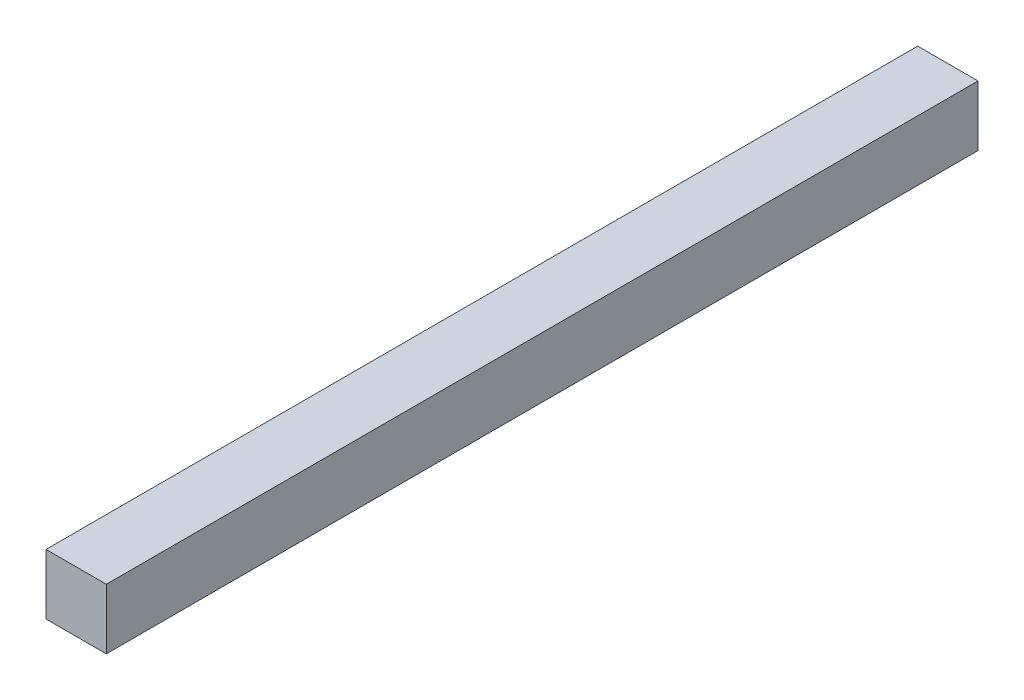
ISO-10303-21;
HEADER;
FILE_DESCRIPTION(('STEP AP214'),'2;1');
FILE_NAME('part.step','',(''),(''),'','','');
FILE_SCHEMA(('AUTOMOTIVE_DESIGN { 1 0 10303 214 1 1 1 1 }'));
ENDSEC;
DATA;
#1=APPLICATION_CONTEXT('core data for automotive mechanical design processes');
#2=APPLICATION_PROTOCOL_DEFINITION('international standard','automotive_design',2000,#1);
#3=PRODUCT_CONTEXT('',#1,'mechanical');
#4=PRODUCT('Part','Part','',(#3));
#5=PRODUCT_RELATED_PRODUCT_CATEGORY('part','',(#4));
#6=PRODUCT_DEFINITION_FORMATION('','',#4);
#7=PRODUCT_DEFINITION_CONTEXT('part definition',#1,'design');
#8=PRODUCT_DEFINITION('design','',#6,#7);
#9=PRODUCT_DEFINITION_SHAPE('','',#8);
#10=(LENGTH_UNIT() NAMED_UNIT(*) SI_UNIT(.MILLI.,.METRE.));
#11=(NAMED_UNIT(*) PLANE_ANGLE_UNIT() SI_UNIT($,.RADIAN.));
#12=(NAMED_UNIT(*) SI_UNIT($,.STERADIAN.) SOLID_ANGLE_UNIT());
#13=UNCERTAINTY_MEASURE_WITH_UNIT(LENGTH_MEASURE(1.E-05),#10,'distance_accuracy_value','');
#14=(GEOMETRIC_REPRESENTATION_CONTEXT(3) GLOBAL_UNCERTAINTY_ASSIGNED_CONTEXT((#13)) GLOBAL_UNIT_ASSIGNED_CONTEXT((#10,
#11,#12)) REPRESENTATION_CONTEXT('',''));
#15=CARTESIAN_POINT('',(0.,0.,0.));
#16=DIRECTION('',(0.,0.,1.));
#17=DIRECTION('',(1.,0.,0.));
#18=AXIS2_PLACEMENT_3D('',#15,#16,#17);
#19=CARTESIAN_POINT('',(16.5,16.5,477.));
#20=DIRECTION('',(-1.,0.,0.));
#21=DIRECTION('',(0.,-1.,0.));
#22=AXIS2_PLACEMENT_3D('',#19,#20,#21);
#23=PLANE('',#22);
#24=DIRECTION('',(0.,1.,0.));
#25=VECTOR('',#24,1.);
#26=CARTESIAN_POINT('',(16.5,16.5,0.));
#27=LINE('',#26,#25);
#28=CARTESIAN_POINT('',(16.5,-16.5,0.));
#29=VERTEX_POINT('',#28);
#30=CARTESIAN_POINT('',(16.5,16.5,0.));
#31=VERTEX_POINT('',#30);
#32=EDGE_CURVE('E130',#29,#31,#27,.T.);
#33=ORIENTED_EDGE('',*,*,#32,.T.);
#34=DIRECTION('',(0.,0.,-1.));
#35=VECTOR('',#34,1.);
#36=CARTESIAN_POINT('',(16.5,16.5,477.));
#37=LINE('',#36,#35);
#38=CARTESIAN_POINT('',(16.5,16.5,477.));
#39=VERTEX_POINT('',#38);
#40=EDGE_CURVE('E13',#39,#31,#37,.T.);
#41=ORIENTED_EDGE('',*,*,#40,.F.);
#42=DIRECTION('',(0.,1.,0.));
#43=VECTOR('',#42,1.);
#44=CARTESIAN_POINT('',(16.5,16.5,477.));
#45=LINE('',#44,#43);
#46=CARTESIAN_POINT('',(16.5,-16.5,477.));
#47=VERTEX_POINT('',#46);
#48=EDGE_CURVE('E131',#47,#39,#45,.T.);
#49=ORIENTED_EDGE('',*,*,#48,.F.);
#50=DIRECTION('',(0.,0.,-1.));
#51=VECTOR('',#50,1.);
#52=CARTESIAN_POINT('',(16.5,-16.5,477.));
#53=LINE('',#52,#51);
#54=EDGE_CURVE('E137',#47,#29,#53,.T.);
#55=ORIENTED_EDGE('',*,*,#54,.T.);
#56=EDGE_LOOP('',(#33,#41,#49,#55));
#57=FACE_BOUND('',#56,.T.);
#58=ADVANCED_FACE('F46',(#57),#23,.F.);
#59=CARTESIAN_POINT('',(-16.5,16.5,477.));
#60=DIRECTION('',(0.,-1.,0.));
#61=DIRECTION('',(0.,0.,-1.));
#62=AXIS2_PLACEMENT_3D('',#59,#60,#61);
#63=PLANE('',#62);
#64=DIRECTION('',(-1.,0.,0.));
#65=VECTOR('',#64,1.);
#66=CARTESIAN_POINT('',(-16.5,16.5,0.));
#67=LINE('',#66,#65);
#68=CARTESIAN_POINT('',(-16.5,16.5,0.));
#69=VERTEX_POINT('',#68);
#70=EDGE_CURVE('E140',#31,#69,#67,.T.);
#71=ORIENTED_EDGE('',*,*,#70,.T.);
#72=DIRECTION('',(0.,0.,-1.));
#73=VECTOR('',#72,1.);
#74=CARTESIAN_POINT('',(-16.5,16.5,477.));
#75=LINE('',#74,#73);
#76=CARTESIAN_POINT('',(-16.5,16.5,477.));
#77=VERTEX_POINT('',#76);
#78=EDGE_CURVE('E54',#77,#69,#75,.T.);
#79=ORIENTED_EDGE('',*,*,#78,.F.);
#80=DIRECTION('',(-1.,0.,0.));
#81=VECTOR('',#80,1.);
#82=CARTESIAN_POINT('',(-16.5,16.5,477.));
#83=LINE('',#82,#81);
#84=EDGE_CURVE('E93',#39,#77,#83,.T.);
#85=ORIENTED_EDGE('',*,*,#84,.F.);
#86=ORIENTED_EDGE('',*,*,#40,.T.);
#87=EDGE_LOOP('',(#71,#79,#85,#86));
#88=FACE_BOUND('',#87,.T.);
#89=ADVANCED_FACE('F164',(#88),#63,.F.);
#90=CARTESIAN_POINT('',(-16.5,16.5,477.));
#91=DIRECTION('',(1.,0.,0.));
#92=DIRECTION('',(0.,1.,0.));
#93=AXIS2_PLACEMENT_3D('',#90,#91,#92);
#94=PLANE('',#93);
#95=DIRECTION('',(0.,-1.,0.));
#96=VECTOR('',#95,1.);
#97=CARTESIAN_POINT('',(-16.5,16.5,0.));
#98=LINE('',#97,#96);
#99=CARTESIAN_POINT('',(-16.5,-16.5,0.));
#100=VERTEX_POINT('',#99);
#101=EDGE_CURVE('E80',#69,#100,#98,.T.);
#102=ORIENTED_EDGE('',*,*,#101,.T.);
#103=DIRECTION('',(0.,0.,-1.));
#104=VECTOR('',#103,1.);
#105=CARTESIAN_POINT('',(-16.5,-16.5,477.));
#106=LINE('',#105,#104);
#107=CARTESIAN_POINT('',(-16.5,-16.5,477.));
#108=VERTEX_POINT('',#107);
#109=EDGE_CURVE('E145',#108,#100,#106,.T.);
#110=ORIENTED_EDGE('',*,*,#109,.F.);
#111=DIRECTION('',(0.,-1.,0.));
#112=VECTOR('',#111,1.);
#113=CARTESIAN_POINT('',(-16.5,16.5,477.));
#114=LINE('',#113,#112);
#115=EDGE_CURVE('E134',#77,#108,#114,.T.);
#116=ORIENTED_EDGE('',*,*,#115,.F.);
#117=ORIENTED_EDGE('',*,*,#78,.T.);
#118=EDGE_LOOP('',(#102,#110,#116,#117));
#119=FACE_BOUND('',#118,.T.);
#120=ADVANCED_FACE('F147',(#119),#94,.F.);
#121=CARTESIAN_POINT('',(-16.5,-16.5,477.));
#122=DIRECTION('',(0.,1.,0.));
#123=DIRECTION('',(0.,0.,1.));
#124=AXIS2_PLACEMENT_3D('',#121,#122,#123);
#125=PLANE('',#124);
#126=CARTESIAN_POINT('',(0.,-16.5,437.));
#127=DIRECTION('',(0.,-1.,0.));
#128=DIRECTION('',(0.,0.,-1.));
#129=AXIS2_PLACEMENT_3D('',#126,#127,#128);
#130=CIRCLE('',#129,3.5);
#131=CARTESIAN_POINT('',(0.,-16.5,433.5));
#132=VERTEX_POINT('',#131);
#133=EDGE_CURVE('E114',#132,#132,#130,.T.);
#134=ORIENTED_EDGE('',*,*,#133,.F.);
#135=EDGE_LOOP('',(#134));
#136=FACE_BOUND('',#135,.T.);
#137=CARTESIAN_POINT('',(0.,-16.5,349.5));
#138=DIRECTION('',(0.,-1.,0.));
#139=DIRECTION('',(0.,0.,-1.));
#140=AXIS2_PLACEMENT_3D('',#137,#138,#139);
#141=CIRCLE('',#140,3.5);
#142=CARTESIAN_POINT('',(0.,-16.5,346.));
#143=VERTEX_POINT('',#142);
#144=EDGE_CURVE('E113',#143,#143,#141,.T.);
#145=ORIENTED_EDGE('',*,*,#144,.F.);
#146=EDGE_LOOP('',(#145));
#147=FACE_BOUND('',#146,.T.);
#148=CARTESIAN_POINT('',(0.,-16.5,262.));
#149=DIRECTION('',(0.,-1.,0.));
#150=DIRECTION('',(0.,0.,-1.));
#151=AXIS2_PLACEMENT_3D('',#148,#149,#150);
#152=CIRCLE('',#151,3.5);
#153=CARTESIAN_POINT('',(0.,-16.5,258.5));
#154=VERTEX_POINT('',#153);
#155=EDGE_CURVE('E124',#154,#154,#152,.T.);
#156=ORIENTED_EDGE('',*,*,#155,.F.);
#157=EDGE_LOOP('',(#156));
#158=FACE_BOUND('',#157,.T.);
#159=DIRECTION('',(1.,0.,0.));
#160=VECTOR('',#159,1.);
#161=CARTESIAN_POINT('',(-16.5,-16.5,0.));
#162=LINE('',#161,#160);
#163=EDGE_CURVE('E86',#100,#29,#162,.T.);
#164=ORIENTED_EDGE('',*,*,#163,.T.);
#165=ORIENTED_EDGE('',*,*,#54,.F.);
#166=DIRECTION('',(1.,0.,0.));
#167=VECTOR('',#166,1.);
#168=CARTESIAN_POINT('',(-16.5,-16.5,477.));
#169=LINE('',#168,#167);
#170=EDGE_CURVE('E62',#108,#47,#169,.T.);
#171=ORIENTED_EDGE('',*,*,#170,.F.);
#172=ORIENTED_EDGE('',*,*,#109,.T.);
#173=EDGE_LOOP('',(#164,#165,#171,#172));
#174=FACE_BOUND('',#173,.T.);
#175=ADVANCED_FACE('F154',(#136,#147,#158,#174),#125,.F.);
#176=CARTESIAN_POINT('',(0.,0.,477.));
#177=DIRECTION('',(0.,0.,1.));
#178=DIRECTION('',(1.,0.,0.));
#179=AXIS2_PLACEMENT_3D('',#176,#177,#178);
#180=PLANE('',#179);
#181=ORIENTED_EDGE('',*,*,#48,.T.);
#182=ORIENTED_EDGE('',*,*,#84,.T.);
#183=ORIENTED_EDGE('',*,*,#115,.T.);
#184=ORIENTED_EDGE('',*,*,#170,.T.);
#185=EDGE_LOOP('',(#181,#182,#183,#184));
#186=FACE_BOUND('',#185,.T.);
#187=ADVANCED_FACE('F156',(#186),#180,.T.);
#188=CARTESIAN_POINT('',(0.,0.,0.));
#189=DIRECTION('',(0.,0.,1.));
#190=DIRECTION('',(1.,0.,0.));
#191=AXIS2_PLACEMENT_3D('',#188,#189,#190);
#192=PLANE('',#191);
#193=ORIENTED_EDGE('',*,*,#32,.F.);
#194=ORIENTED_EDGE('',*,*,#163,.F.);
#195=ORIENTED_EDGE('',*,*,#101,.F.);
#196=ORIENTED_EDGE('',*,*,#70,.F.);
#197=EDGE_LOOP('',(#193,#194,#195,#196));
#198=FACE_BOUND('',#197,.T.);
#199=ADVANCED_FACE('F150',(#198),#192,.F.);
#200=CARTESIAN_POINT('',(0.,5.75000000000001,262.));
#201=DIRECTION('',(0.,-1.,0.));
#202=DIRECTION('',(0.,0.,-1.));
#203=AXIS2_PLACEMENT_3D('',#200,#201,#202);
#204=CONICAL_SURFACE('',#203,3.49999999999999,1.02974425867665);
#205=CARTESIAN_POINT('',(0.,7.85301216659645,262.));
#206=VERTEX_POINT('',#205);
#207=VERTEX_LOOP('',#206);
#208=FACE_BOUND('',#207,.T.);
#209=CARTESIAN_POINT('',(0.,5.75000000000001,262.));
#210=DIRECTION('',(0.,-1.,0.));
#211=DIRECTION('',(0.,0.,-1.));
#212=AXIS2_PLACEMENT_3D('',#209,#210,#211);
#213=CIRCLE('',#212,3.49999999999999);
#214=CARTESIAN_POINT('',(0.,5.75000000000001,258.5));
#215=VERTEX_POINT('',#214);
#216=EDGE_CURVE('E127',#215,#215,#213,.T.);
#217=ORIENTED_EDGE('',*,*,#216,.T.);
#218=EDGE_LOOP('',(#217));
#219=FACE_BOUND('',#218,.T.);
#220=ADVANCED_FACE('F192',(#208,#219),#204,.F.);
#221=CARTESIAN_POINT('',(0.,-16.5,262.));
#222=DIRECTION('',(0.,-1.,0.));
#223=DIRECTION('',(0.,0.,-1.));
#224=AXIS2_PLACEMENT_3D('',#221,#222,#223);
#225=CYLINDRICAL_SURFACE('',#224,3.5);
#226=ORIENTED_EDGE('',*,*,#216,.F.);
#227=EDGE_LOOP('',(#226));
#228=FACE_BOUND('',#227,.T.);
#229=ORIENTED_EDGE('',*,*,#155,.T.);
#230=EDGE_LOOP('',(#229));
#231=FACE_BOUND('',#230,.T.);
#232=ADVANCED_FACE('F198',(#228,#231),#225,.F.);
#233=CARTESIAN_POINT('',(0.,5.75000000000001,349.5));
#234=DIRECTION('',(0.,-1.,0.));
#235=DIRECTION('',(0.,0.,-1.));
#236=AXIS2_PLACEMENT_3D('',#233,#234,#235);
#237=CONICAL_SURFACE('',#236,3.49999999999999,1.02974425867665);
#238=CARTESIAN_POINT('',(0.,7.85301216659645,349.5));
#239=VERTEX_POINT('',#238);
#240=VERTEX_LOOP('',#239);
#241=FACE_BOUND('',#240,.T.);
#242=CARTESIAN_POINT('',(0.,5.75000000000001,349.5));
#243=DIRECTION('',(0.,-1.,0.));
#244=DIRECTION('',(0.,0.,-1.));
#245=AXIS2_PLACEMENT_3D('',#242,#243,#244);
#246=CIRCLE('',#245,3.49999999999999);
#247=CARTESIAN_POINT('',(0.,5.75000000000001,346.));
#248=VERTEX_POINT('',#247);
#249=EDGE_CURVE('E117',#248,#248,#246,.T.);
#250=ORIENTED_EDGE('',*,*,#249,.T.);
#251=EDGE_LOOP('',(#250));
#252=FACE_BOUND('',#251,.T.);
#253=ADVANCED_FACE('F206',(#241,#252),#237,.F.);
#254=CARTESIAN_POINT('',(0.,-16.5,349.5));
#255=DIRECTION('',(0.,-1.,0.));
#256=DIRECTION('',(0.,0.,-1.));
#257=AXIS2_PLACEMENT_3D('',#254,#255,#256);
#258=CYLINDRICAL_SURFACE('',#257,3.5);
#259=ORIENTED_EDGE('',*,*,#249,.F.);
#260=EDGE_LOOP('',(#259));
#261=FACE_BOUND('',#260,.T.);
#262=ORIENTED_EDGE('',*,*,#144,.T.);
#263=EDGE_LOOP('',(#262));
#264=FACE_BOUND('',#263,.T.);
#265=ADVANCED_FACE('F107',(#261,#264),#258,.F.);
#266=CARTESIAN_POINT('',(0.,5.75000000000001,437.));
#267=DIRECTION('',(0.,-1.,0.));
#268=DIRECTION('',(0.,0.,-1.));
#269=AXIS2_PLACEMENT_3D('',#266,#267,#268);
#270=CONICAL_SURFACE('',#269,3.49999999999999,1.02974425867665);
#271=CARTESIAN_POINT('',(0.,7.85301216659645,437.));
#272=VERTEX_POINT('',#271);
#273=VERTEX_LOOP('',#272);
#274=FACE_BOUND('',#273,.T.);
#275=CARTESIAN_POINT('',(0.,5.75000000000001,437.));
#276=DIRECTION('',(0.,-1.,0.));
#277=DIRECTION('',(0.,0.,-1.));
#278=AXIS2_PLACEMENT_3D('',#275,#276,#277);
#279=CIRCLE('',#278,3.49999999999999);
#280=CARTESIAN_POINT('',(0.,5.75000000000001,433.5));
#281=VERTEX_POINT('',#280);
#282=EDGE_CURVE('E111',#281,#281,#279,.T.);
#283=ORIENTED_EDGE('',*,*,#282,.T.);
#284=EDGE_LOOP('',(#283));
#285=FACE_BOUND('',#284,.T.);
#286=ADVANCED_FACE('F103',(#274,#285),#270,.F.);
#287=CARTESIAN_POINT('',(0.,-16.5,437.));
#288=DIRECTION('',(0.,-1.,0.));
#289=DIRECTION('',(0.,0.,-1.));
#290=AXIS2_PLACEMENT_3D('',#287,#288,#289);
#291=CYLINDRICAL_SURFACE('',#290,3.5);
#292=ORIENTED_EDGE('',*,*,#282,.F.);
#293=EDGE_LOOP('',(#292));
#294=FACE_BOUND('',#293,.T.);
#295=ORIENTED_EDGE('',*,*,#133,.T.);
#296=EDGE_LOOP('',(#295));
#297=FACE_BOUND('',#296,.T.);
#298=ADVANCED_FACE('F106',(#294,#297),#291,.F.);
#299=CLOSED_SHELL('',(#58,#89,#120,#175,#187,#199,#220,#232,#253,#265,#286,#298));
#300=MANIFOLD_SOLID_BREP('B2',#299);
#301=ADVANCED_BREP_SHAPE_REPRESENTATION('',(#18,#300),#14);
#302=SHAPE_DEFINITION_REPRESENTATION(#9,#301);
ENDSEC;
END-ISO-10303-21;
